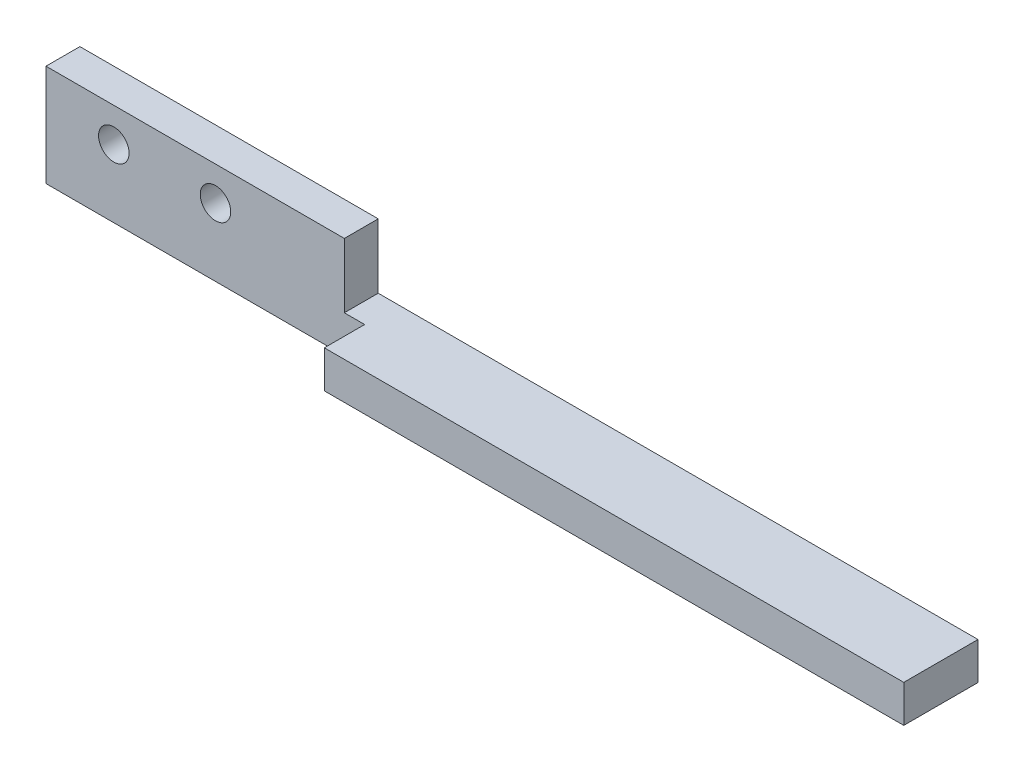
ISO-10303-21;
HEADER;
FILE_DESCRIPTION(('STEP AP214'),'2;1');
FILE_NAME('part.step','',(''),(''),'','','');
FILE_SCHEMA(('AUTOMOTIVE_DESIGN { 1 0 10303 214 1 1 1 1 }'));
ENDSEC;
DATA;
#1=APPLICATION_CONTEXT('core data for automotive mechanical design processes');
#2=APPLICATION_PROTOCOL_DEFINITION('international standard','automotive_design',2000,#1);
#3=PRODUCT_CONTEXT('',#1,'mechanical');
#4=PRODUCT('Part','Part','',(#3));
#5=PRODUCT_RELATED_PRODUCT_CATEGORY('part','',(#4));
#6=PRODUCT_DEFINITION_FORMATION('','',#4);
#7=PRODUCT_DEFINITION_CONTEXT('part definition',#1,'design');
#8=PRODUCT_DEFINITION('design','',#6,#7);
#9=PRODUCT_DEFINITION_SHAPE('','',#8);
#10=(LENGTH_UNIT() NAMED_UNIT(*) SI_UNIT(.MILLI.,.METRE.));
#11=(NAMED_UNIT(*) PLANE_ANGLE_UNIT() SI_UNIT($,.RADIAN.));
#12=(NAMED_UNIT(*) SI_UNIT($,.STERADIAN.) SOLID_ANGLE_UNIT());
#13=UNCERTAINTY_MEASURE_WITH_UNIT(LENGTH_MEASURE(1.E-05),#10,'distance_accuracy_value','');
#14=(GEOMETRIC_REPRESENTATION_CONTEXT(3) GLOBAL_UNCERTAINTY_ASSIGNED_CONTEXT((#13)) GLOBAL_UNIT_ASSIGNED_CONTEXT((#10,
#11,#12)) REPRESENTATION_CONTEXT('',''));
#15=CARTESIAN_POINT('',(0.,0.,0.));
#16=DIRECTION('',(0.,0.,1.));
#17=DIRECTION('',(1.,0.,0.));
#18=AXIS2_PLACEMENT_3D('',#15,#16,#17);
#19=CARTESIAN_POINT('',(0.,0.,5.));
#20=DIRECTION('',(0.,0.,-1.));
#21=DIRECTION('',(-1.,0.,0.));
#22=AXIS2_PLACEMENT_3D('',#19,#20,#21);
#23=PLANE('',#22);
#24=CARTESIAN_POINT('',(25.,5.,5.));
#25=DIRECTION('',(0.,0.,-1.));
#26=DIRECTION('',(-1.,0.,0.));
#27=AXIS2_PLACEMENT_3D('',#24,#25,#26);
#28=CIRCLE('',#27,2.25);
#29=CARTESIAN_POINT('',(22.75,5.,5.));
#30=VERTEX_POINT('',#29);
#31=EDGE_CURVE('E216',#30,#30,#28,.T.);
#32=ORIENTED_EDGE('',*,*,#31,.T.);
#33=EDGE_LOOP('',(#32));
#34=FACE_BOUND('',#33,.T.);
#35=CARTESIAN_POINT('',(10.,5.,5.));
#36=DIRECTION('',(0.,0.,-1.));
#37=DIRECTION('',(-1.,0.,0.));
#38=AXIS2_PLACEMENT_3D('',#35,#36,#37);
#39=CIRCLE('',#38,2.25);
#40=CARTESIAN_POINT('',(7.75,5.,5.));
#41=VERTEX_POINT('',#40);
#42=EDGE_CURVE('E105',#41,#41,#39,.T.);
#43=ORIENTED_EDGE('',*,*,#42,.T.);
#44=EDGE_LOOP('',(#43));
#45=FACE_BOUND('',#44,.T.);
#46=DIRECTION('',(1.,0.,0.));
#47=VECTOR('',#46,1.);
#48=CARTESIAN_POINT('',(0.,10.,5.00000000000001));
#49=LINE('',#48,#47);
#50=CARTESIAN_POINT('',(0.,10.,5.00000000000001));
#51=VERTEX_POINT('',#50);
#52=CARTESIAN_POINT('',(44.,10.,5.00000000000001));
#53=VERTEX_POINT('',#52);
#54=EDGE_CURVE('E50',#51,#53,#49,.T.);
#55=ORIENTED_EDGE('',*,*,#54,.F.);
#56=DIRECTION('',(0.,-1.,0.));
#57=VECTOR('',#56,1.);
#58=CARTESIAN_POINT('',(0.,0.,5.));
#59=LINE('',#58,#57);
#60=CARTESIAN_POINT('',(0.,-5.,5.));
#61=VERTEX_POINT('',#60);
#62=EDGE_CURVE('E11',#51,#61,#59,.T.);
#63=ORIENTED_EDGE('',*,*,#62,.T.);
#64=DIRECTION('',(-1.,0.,0.));
#65=VECTOR('',#64,1.);
#66=CARTESIAN_POINT('',(100.,-5.,5.));
#67=LINE('',#66,#65);
#68=CARTESIAN_POINT('',(47.,-5.00000000000001,5.));
#69=VERTEX_POINT('',#68);
#70=EDGE_CURVE('E127',#69,#61,#67,.T.);
#71=ORIENTED_EDGE('',*,*,#70,.F.);
#72=DIRECTION('',(0.,-1.,0.));
#73=VECTOR('',#72,1.);
#74=CARTESIAN_POINT('',(47.,-5.00000000000001,5.));
#75=LINE('',#74,#73);
#76=CARTESIAN_POINT('',(47.,0.5,5.));
#77=VERTEX_POINT('',#76);
#78=EDGE_CURVE('E58',#77,#69,#75,.T.);
#79=ORIENTED_EDGE('',*,*,#78,.F.);
#80=DIRECTION('',(1.,0.,0.));
#81=VECTOR('',#80,1.);
#82=CARTESIAN_POINT('',(44.,0.5,5.));
#83=LINE('',#82,#81);
#84=CARTESIAN_POINT('',(44.,0.5,5.));
#85=VERTEX_POINT('',#84);
#86=EDGE_CURVE('E123',#85,#77,#83,.T.);
#87=ORIENTED_EDGE('',*,*,#86,.F.);
#88=DIRECTION('',(0.,1.,0.));
#89=VECTOR('',#88,1.);
#90=CARTESIAN_POINT('',(44.,15.,5.00000000000001));
#91=LINE('',#90,#89);
#92=EDGE_CURVE('E109',#85,#53,#91,.T.);
#93=ORIENTED_EDGE('',*,*,#92,.T.);
#94=EDGE_LOOP('',(#55,#63,#71,#79,#87,#93));
#95=FACE_BOUND('',#94,.T.);
#96=ADVANCED_FACE('F35',(#34,#45,#95),#23,.F.);
#97=CARTESIAN_POINT('',(0.,0.,5.));
#98=DIRECTION('',(1.,0.,0.));
#99=DIRECTION('',(0.,0.,-1.));
#100=AXIS2_PLACEMENT_3D('',#97,#98,#99);
#101=PLANE('',#100);
#102=DIRECTION('',(0.,0.,1.));
#103=VECTOR('',#102,1.);
#104=CARTESIAN_POINT('',(0.,10.,0.));
#105=LINE('',#104,#103);
#106=CARTESIAN_POINT('',(0.,10.,0.));
#107=VERTEX_POINT('',#106);
#108=EDGE_CURVE('E98',#107,#51,#105,.T.);
#109=ORIENTED_EDGE('',*,*,#108,.F.);
#110=DIRECTION('',(0.,-1.,0.));
#111=VECTOR('',#110,1.);
#112=CARTESIAN_POINT('',(0.,0.,0.));
#113=LINE('',#112,#111);
#114=CARTESIAN_POINT('',(0.,-5.,0.));
#115=VERTEX_POINT('',#114);
#116=EDGE_CURVE('E39',#107,#115,#113,.T.);
#117=ORIENTED_EDGE('',*,*,#116,.T.);
#118=DIRECTION('',(0.,0.,-1.));
#119=VECTOR('',#118,1.);
#120=CARTESIAN_POINT('',(0.,-5.,5.));
#121=LINE('',#120,#119);
#122=EDGE_CURVE('E114',#61,#115,#121,.T.);
#123=ORIENTED_EDGE('',*,*,#122,.F.);
#124=ORIENTED_EDGE('',*,*,#62,.F.);
#125=EDGE_LOOP('',(#109,#117,#123,#124));
#126=FACE_BOUND('',#125,.T.);
#127=ADVANCED_FACE('F37',(#126),#101,.F.);
#128=CARTESIAN_POINT('',(0.,0.,0.));
#129=DIRECTION('',(0.,0.,-1.));
#130=DIRECTION('',(-1.,0.,0.));
#131=AXIS2_PLACEMENT_3D('',#128,#129,#130);
#132=PLANE('',#131);
#133=CARTESIAN_POINT('',(25.,5.,0.));
#134=DIRECTION('',(0.,0.,-1.));
#135=DIRECTION('',(1.,0.,0.));
#136=AXIS2_PLACEMENT_3D('',#133,#134,#135);
#137=CIRCLE('',#136,2.25);
#138=CARTESIAN_POINT('',(27.25,5.,0.));
#139=VERTEX_POINT('',#138);
#140=EDGE_CURVE('E211',#139,#139,#137,.T.);
#141=ORIENTED_EDGE('',*,*,#140,.F.);
#142=EDGE_LOOP('',(#141));
#143=FACE_BOUND('',#142,.T.);
#144=CARTESIAN_POINT('',(10.,5.,0.));
#145=DIRECTION('',(0.,0.,-1.));
#146=DIRECTION('',(-1.,0.,0.));
#147=AXIS2_PLACEMENT_3D('',#144,#145,#146);
#148=CIRCLE('',#147,2.25);
#149=CARTESIAN_POINT('',(7.75,5.,0.));
#150=VERTEX_POINT('',#149);
#151=EDGE_CURVE('E214',#150,#150,#148,.T.);
#152=ORIENTED_EDGE('',*,*,#151,.F.);
#153=EDGE_LOOP('',(#152));
#154=FACE_BOUND('',#153,.T.);
#155=ORIENTED_EDGE('',*,*,#116,.F.);
#156=DIRECTION('',(-1.,0.,0.));
#157=VECTOR('',#156,1.);
#158=CARTESIAN_POINT('',(0.,10.,0.));
#159=LINE('',#158,#157);
#160=CARTESIAN_POINT('',(44.,10.,0.));
#161=VERTEX_POINT('',#160);
#162=EDGE_CURVE('E101',#161,#107,#159,.T.);
#163=ORIENTED_EDGE('',*,*,#162,.F.);
#164=DIRECTION('',(0.,1.,0.));
#165=VECTOR('',#164,1.);
#166=CARTESIAN_POINT('',(44.,15.,0.));
#167=LINE('',#166,#165);
#168=CARTESIAN_POINT('',(44.,0.5,0.));
#169=VERTEX_POINT('',#168);
#170=EDGE_CURVE('E117',#169,#161,#167,.T.);
#171=ORIENTED_EDGE('',*,*,#170,.F.);
#172=DIRECTION('',(-1.,0.,0.));
#173=VECTOR('',#172,1.);
#174=CARTESIAN_POINT('',(44.,0.5,0.));
#175=LINE('',#174,#173);
#176=CARTESIAN_POINT('',(132.46,0.5,0.));
#177=VERTEX_POINT('',#176);
#178=EDGE_CURVE('E118',#177,#169,#175,.T.);
#179=ORIENTED_EDGE('',*,*,#178,.F.);
#180=DIRECTION('',(0.,1.,0.));
#181=VECTOR('',#180,1.);
#182=CARTESIAN_POINT('',(132.46,0.5,0.));
#183=LINE('',#182,#181);
#184=CARTESIAN_POINT('',(132.46,-5.,0.));
#185=VERTEX_POINT('',#184);
#186=EDGE_CURVE('E143',#185,#177,#183,.T.);
#187=ORIENTED_EDGE('',*,*,#186,.F.);
#188=DIRECTION('',(1.,0.,0.));
#189=VECTOR('',#188,1.);
#190=CARTESIAN_POINT('',(100.,-5.,0.));
#191=LINE('',#190,#189);
#192=EDGE_CURVE('E130',#115,#185,#191,.T.);
#193=ORIENTED_EDGE('',*,*,#192,.F.);
#194=EDGE_LOOP('',(#155,#163,#171,#179,#187,#193));
#195=FACE_BOUND('',#194,.T.);
#196=ADVANCED_FACE('F147',(#143,#154,#195),#132,.T.);
#197=CARTESIAN_POINT('',(44.,15.,5.00000000000001));
#198=DIRECTION('',(-1.,0.,0.));
#199=DIRECTION('',(0.,0.,1.));
#200=AXIS2_PLACEMENT_3D('',#197,#198,#199);
#201=PLANE('',#200);
#202=DIRECTION('',(0.,0.,-1.));
#203=VECTOR('',#202,1.);
#204=CARTESIAN_POINT('',(44.,10.,0.));
#205=LINE('',#204,#203);
#206=EDGE_CURVE('E110',#53,#161,#205,.T.);
#207=ORIENTED_EDGE('',*,*,#206,.F.);
#208=ORIENTED_EDGE('',*,*,#92,.F.);
#209=DIRECTION('',(0.,0.,1.));
#210=VECTOR('',#209,1.);
#211=CARTESIAN_POINT('',(44.,0.5,0.));
#212=LINE('',#211,#210);
#213=EDGE_CURVE('E169',#169,#85,#212,.T.);
#214=ORIENTED_EDGE('',*,*,#213,.F.);
#215=ORIENTED_EDGE('',*,*,#170,.T.);
#216=EDGE_LOOP('',(#207,#208,#214,#215));
#217=FACE_BOUND('',#216,.T.);
#218=ADVANCED_FACE('F201',(#217),#201,.F.);
#219=CARTESIAN_POINT('',(0.,-5.,0.));
#220=DIRECTION('',(0.,-1.,0.));
#221=DIRECTION('',(0.,0.,-1.));
#222=AXIS2_PLACEMENT_3D('',#219,#220,#221);
#223=PLANE('',#222);
#224=ORIENTED_EDGE('',*,*,#192,.T.);
#225=DIRECTION('',(0.,0.,-1.));
#226=VECTOR('',#225,1.);
#227=CARTESIAN_POINT('',(132.46,-5.,0.));
#228=LINE('',#227,#226);
#229=CARTESIAN_POINT('',(132.46,-5.,10.95));
#230=VERTEX_POINT('',#229);
#231=EDGE_CURVE('E135',#230,#185,#228,.T.);
#232=ORIENTED_EDGE('',*,*,#231,.F.);
#233=DIRECTION('',(1.,0.,0.));
#234=VECTOR('',#233,1.);
#235=CARTESIAN_POINT('',(100.,-5.,10.95));
#236=LINE('',#235,#234);
#237=CARTESIAN_POINT('',(47.,-5.00000000000001,10.95));
#238=VERTEX_POINT('',#237);
#239=EDGE_CURVE('E160',#238,#230,#236,.T.);
#240=ORIENTED_EDGE('',*,*,#239,.F.);
#241=DIRECTION('',(0.,0.,-1.));
#242=VECTOR('',#241,1.);
#243=CARTESIAN_POINT('',(47.,-5.00000000000001,10.95));
#244=LINE('',#243,#242);
#245=EDGE_CURVE('E162',#238,#69,#244,.T.);
#246=ORIENTED_EDGE('',*,*,#245,.T.);
#247=ORIENTED_EDGE('',*,*,#70,.T.);
#248=ORIENTED_EDGE('',*,*,#122,.T.);
#249=EDGE_LOOP('',(#224,#232,#240,#246,#247,#248));
#250=FACE_BOUND('',#249,.T.);
#251=ADVANCED_FACE('F133',(#250),#223,.T.);
#252=CARTESIAN_POINT('',(0.,0.5,0.));
#253=DIRECTION('',(0.,1.,0.));
#254=DIRECTION('',(0.,0.,1.));
#255=AXIS2_PLACEMENT_3D('',#252,#253,#254);
#256=PLANE('',#255);
#257=ORIENTED_EDGE('',*,*,#213,.T.);
#258=ORIENTED_EDGE('',*,*,#86,.T.);
#259=DIRECTION('',(0.,0.,-1.));
#260=VECTOR('',#259,1.);
#261=CARTESIAN_POINT('',(47.,0.5,10.95));
#262=LINE('',#261,#260);
#263=CARTESIAN_POINT('',(47.,0.5,10.95));
#264=VERTEX_POINT('',#263);
#265=EDGE_CURVE('E166',#264,#77,#262,.T.);
#266=ORIENTED_EDGE('',*,*,#265,.F.);
#267=DIRECTION('',(-1.,0.,0.));
#268=VECTOR('',#267,1.);
#269=CARTESIAN_POINT('',(100.,0.5,10.95));
#270=LINE('',#269,#268);
#271=CARTESIAN_POINT('',(132.46,0.5,10.95));
#272=VERTEX_POINT('',#271);
#273=EDGE_CURVE('E156',#272,#264,#270,.T.);
#274=ORIENTED_EDGE('',*,*,#273,.F.);
#275=DIRECTION('',(0.,0.,1.));
#276=VECTOR('',#275,1.);
#277=CARTESIAN_POINT('',(132.46,0.5,0.));
#278=LINE('',#277,#276);
#279=EDGE_CURVE('E149',#177,#272,#278,.T.);
#280=ORIENTED_EDGE('',*,*,#279,.F.);
#281=ORIENTED_EDGE('',*,*,#178,.T.);
#282=EDGE_LOOP('',(#257,#258,#266,#274,#280,#281));
#283=FACE_BOUND('',#282,.T.);
#284=ADVANCED_FACE('F173',(#283),#256,.T.);
#285=CARTESIAN_POINT('',(47.,-5.00000000000001,10.95));
#286=DIRECTION('',(1.,0.,0.));
#287=DIRECTION('',(0.,0.,-1.));
#288=AXIS2_PLACEMENT_3D('',#285,#286,#287);
#289=PLANE('',#288);
#290=ORIENTED_EDGE('',*,*,#78,.T.);
#291=ORIENTED_EDGE('',*,*,#245,.F.);
#292=DIRECTION('',(0.,-1.,0.));
#293=VECTOR('',#292,1.);
#294=CARTESIAN_POINT('',(47.,-5.00000000000001,10.95));
#295=LINE('',#294,#293);
#296=EDGE_CURVE('E158',#264,#238,#295,.T.);
#297=ORIENTED_EDGE('',*,*,#296,.F.);
#298=ORIENTED_EDGE('',*,*,#265,.T.);
#299=EDGE_LOOP('',(#290,#291,#297,#298));
#300=FACE_BOUND('',#299,.T.);
#301=ADVANCED_FACE('F177',(#300),#289,.F.);
#302=CARTESIAN_POINT('',(0.,0.,10.95));
#303=DIRECTION('',(0.,0.,1.));
#304=DIRECTION('',(1.,0.,0.));
#305=AXIS2_PLACEMENT_3D('',#302,#303,#304);
#306=PLANE('',#305);
#307=ORIENTED_EDGE('',*,*,#239,.T.);
#308=DIRECTION('',(0.,-1.,0.));
#309=VECTOR('',#308,1.);
#310=CARTESIAN_POINT('',(132.46,0.5,10.95));
#311=LINE('',#310,#309);
#312=EDGE_CURVE('E145',#272,#230,#311,.T.);
#313=ORIENTED_EDGE('',*,*,#312,.F.);
#314=ORIENTED_EDGE('',*,*,#273,.T.);
#315=ORIENTED_EDGE('',*,*,#296,.T.);
#316=EDGE_LOOP('',(#307,#313,#314,#315));
#317=FACE_BOUND('',#316,.T.);
#318=ADVANCED_FACE('F180',(#317),#306,.T.);
#319=CARTESIAN_POINT('',(132.46,0.,0.));
#320=DIRECTION('',(-1.,0.,0.));
#321=DIRECTION('',(0.,0.,1.));
#322=AXIS2_PLACEMENT_3D('',#319,#320,#321);
#323=PLANE('',#322);
#324=ORIENTED_EDGE('',*,*,#186,.T.);
#325=ORIENTED_EDGE('',*,*,#279,.T.);
#326=ORIENTED_EDGE('',*,*,#312,.T.);
#327=ORIENTED_EDGE('',*,*,#231,.T.);
#328=EDGE_LOOP('',(#324,#325,#326,#327));
#329=FACE_BOUND('',#328,.T.);
#330=ADVANCED_FACE('F141',(#329),#323,.F.);
#331=CARTESIAN_POINT('',(0.,10.,0.));
#332=DIRECTION('',(0.,1.,0.));
#333=DIRECTION('',(0.,0.,1.));
#334=AXIS2_PLACEMENT_3D('',#331,#332,#333);
#335=PLANE('',#334);
#336=ORIENTED_EDGE('',*,*,#108,.T.);
#337=ORIENTED_EDGE('',*,*,#54,.T.);
#338=ORIENTED_EDGE('',*,*,#206,.T.);
#339=ORIENTED_EDGE('',*,*,#162,.T.);
#340=EDGE_LOOP('',(#336,#337,#338,#339));
#341=FACE_BOUND('',#340,.T.);
#342=ADVANCED_FACE('F99',(#341),#335,.T.);
#343=CARTESIAN_POINT('',(10.,5.,15.));
#344=DIRECTION('',(0.,0.,-1.));
#345=DIRECTION('',(-1.,0.,0.));
#346=AXIS2_PLACEMENT_3D('',#343,#344,#345);
#347=CYLINDRICAL_SURFACE('',#346,2.25);
#348=ORIENTED_EDGE('',*,*,#151,.T.);
#349=EDGE_LOOP('',(#348));
#350=FACE_BOUND('',#349,.T.);
#351=ORIENTED_EDGE('',*,*,#42,.F.);
#352=EDGE_LOOP('',(#351));
#353=FACE_BOUND('',#352,.T.);
#354=ADVANCED_FACE('F226',(#350,#353),#347,.F.);
#355=CARTESIAN_POINT('',(25.,5.,15.));
#356=DIRECTION('',(0.,0.,-1.));
#357=DIRECTION('',(-1.,0.,0.));
#358=AXIS2_PLACEMENT_3D('',#355,#356,#357);
#359=CYLINDRICAL_SURFACE('',#358,2.25);
#360=ORIENTED_EDGE('',*,*,#140,.T.);
#361=EDGE_LOOP('',(#360));
#362=FACE_BOUND('',#361,.T.);
#363=ORIENTED_EDGE('',*,*,#31,.F.);
#364=EDGE_LOOP('',(#363));
#365=FACE_BOUND('',#364,.T.);
#366=ADVANCED_FACE('F223',(#362,#365),#359,.F.);
#367=CLOSED_SHELL('',(#96,#127,#196,#218,#251,#284,#301,#318,#330,#342,#354,#366));
#368=MANIFOLD_SOLID_BREP('B2',#367);
#369=ADVANCED_BREP_SHAPE_REPRESENTATION('',(#18,#368),#14);
#370=SHAPE_DEFINITION_REPRESENTATION(#9,#369);
ENDSEC;
END-ISO-10303-21;
